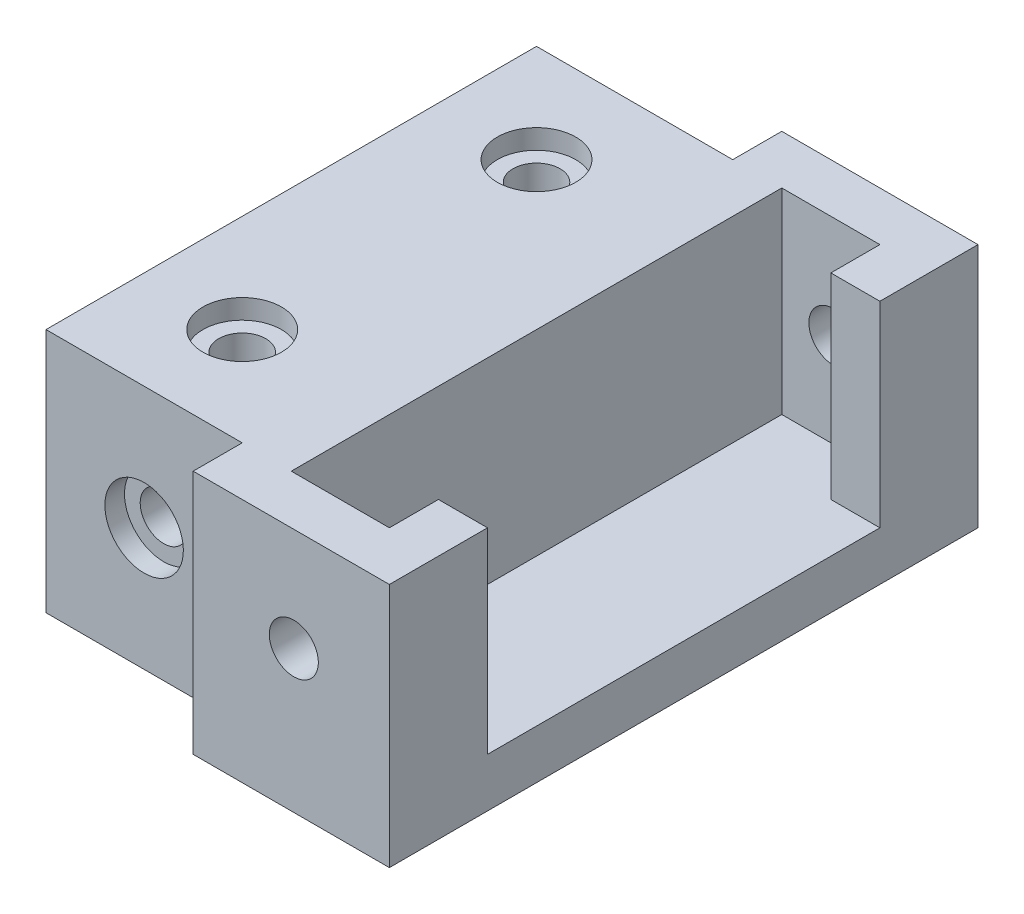
ISO-10303-21;
HEADER;
FILE_DESCRIPTION(('STEP AP214'),'2;1');
FILE_NAME('part.step','',(''),(''),'','','');
FILE_SCHEMA(('AUTOMOTIVE_DESIGN { 1 0 10303 214 1 1 1 1 }'));
ENDSEC;
DATA;
#1=APPLICATION_CONTEXT('core data for automotive mechanical design processes');
#2=APPLICATION_PROTOCOL_DEFINITION('international standard','automotive_design',2000,#1);
#3=PRODUCT_CONTEXT('',#1,'mechanical');
#4=PRODUCT('Part','Part','',(#3));
#5=PRODUCT_RELATED_PRODUCT_CATEGORY('part','',(#4));
#6=PRODUCT_DEFINITION_FORMATION('','',#4);
#7=PRODUCT_DEFINITION_CONTEXT('part definition',#1,'design');
#8=PRODUCT_DEFINITION('design','',#6,#7);
#9=PRODUCT_DEFINITION_SHAPE('','',#8);
#10=(LENGTH_UNIT() NAMED_UNIT(*) SI_UNIT(.MILLI.,.METRE.));
#11=(NAMED_UNIT(*) PLANE_ANGLE_UNIT() SI_UNIT($,.RADIAN.));
#12=(NAMED_UNIT(*) SI_UNIT($,.STERADIAN.) SOLID_ANGLE_UNIT());
#13=UNCERTAINTY_MEASURE_WITH_UNIT(LENGTH_MEASURE(1.E-05),#10,'distance_accuracy_value','');
#14=(GEOMETRIC_REPRESENTATION_CONTEXT(3) GLOBAL_UNCERTAINTY_ASSIGNED_CONTEXT((#13)) GLOBAL_UNIT_ASSIGNED_CONTEXT((#10,
#11,#12)) REPRESENTATION_CONTEXT('',''));
#15=CARTESIAN_POINT('',(0.,0.,0.));
#16=DIRECTION('',(0.,0.,1.));
#17=DIRECTION('',(1.,0.,0.));
#18=AXIS2_PLACEMENT_3D('',#15,#16,#17);
#19=CARTESIAN_POINT('',(0.,20.,0.));
#20=DIRECTION('',(-1.,0.,0.));
#21=DIRECTION('',(0.,0.,1.));
#22=AXIS2_PLACEMENT_3D('',#19,#20,#21);
#23=PLANE('',#22);
#24=DIRECTION('',(0.,0.,-1.));
#25=VECTOR('',#24,1.);
#26=CARTESIAN_POINT('',(0.,-5.,0.));
#27=LINE('',#26,#25);
#28=CARTESIAN_POINT('',(0.,-5.,-55.));
#29=VERTEX_POINT('',#28);
#30=CARTESIAN_POINT('',(0.,-5.,-60.));
#31=VERTEX_POINT('',#30);
#32=EDGE_CURVE('E224',#29,#31,#27,.T.);
#33=ORIENTED_EDGE('',*,*,#32,.F.);
#34=DIRECTION('',(0.,1.,0.));
#35=VECTOR('',#34,1.);
#36=CARTESIAN_POINT('',(0.,0.,-55.));
#37=LINE('',#36,#35);
#38=CARTESIAN_POINT('',(0.,20.,-55.));
#39=VERTEX_POINT('',#38);
#40=EDGE_CURVE('E68',#29,#39,#37,.T.);
#41=ORIENTED_EDGE('',*,*,#40,.T.);
#42=DIRECTION('',(0.,0.,-1.));
#43=VECTOR('',#42,1.);
#44=CARTESIAN_POINT('',(0.,20.,0.));
#45=LINE('',#44,#43);
#46=CARTESIAN_POINT('',(0.,20.,-60.));
#47=VERTEX_POINT('',#46);
#48=EDGE_CURVE('E246',#39,#47,#45,.T.);
#49=ORIENTED_EDGE('',*,*,#48,.T.);
#50=DIRECTION('',(0.,-1.,0.));
#51=VECTOR('',#50,1.);
#52=CARTESIAN_POINT('',(0.,20.,-60.));
#53=LINE('',#52,#51);
#54=EDGE_CURVE('E292',#47,#31,#53,.T.);
#55=ORIENTED_EDGE('',*,*,#54,.T.);
#56=EDGE_LOOP('',(#33,#41,#49,#55));
#57=FACE_BOUND('',#56,.T.);
#58=ADVANCED_FACE('F43',(#57),#23,.T.);
#59=CARTESIAN_POINT('',(0.,-5.,-10.));
#60=VERTEX_POINT('',#59);
#61=CARTESIAN_POINT('',(0.,-5.,-50.));
#62=VERTEX_POINT('',#61);
#63=EDGE_CURVE('E207',#60,#62,#27,.T.);
#64=ORIENTED_EDGE('',*,*,#63,.F.);
#65=DIRECTION('',(0.,1.,0.));
#66=VECTOR('',#65,1.);
#67=CARTESIAN_POINT('',(0.,0.,-10.));
#68=LINE('',#67,#66);
#69=CARTESIAN_POINT('',(0.,15.,-10.));
#70=VERTEX_POINT('',#69);
#71=EDGE_CURVE('E60',#60,#70,#68,.T.);
#72=ORIENTED_EDGE('',*,*,#71,.T.);
#73=DIRECTION('',(0.,0.,1.));
#74=VECTOR('',#73,1.);
#75=CARTESIAN_POINT('',(0.,15.,0.));
#76=LINE('',#75,#74);
#77=CARTESIAN_POINT('',(0.,15.,-50.));
#78=VERTEX_POINT('',#77);
#79=EDGE_CURVE('E345',#78,#70,#76,.T.);
#80=ORIENTED_EDGE('',*,*,#79,.F.);
#81=DIRECTION('',(0.,1.,0.));
#82=VECTOR('',#81,1.);
#83=CARTESIAN_POINT('',(0.,0.,-50.));
#84=LINE('',#83,#82);
#85=EDGE_CURVE('E330',#62,#78,#84,.T.);
#86=ORIENTED_EDGE('',*,*,#85,.F.);
#87=EDGE_LOOP('',(#64,#72,#80,#86));
#88=FACE_BOUND('',#87,.T.);
#89=ADVANCED_FACE('F370',(#88),#23,.T.);
#90=CARTESIAN_POINT('',(5.,20.,0.));
#91=DIRECTION('',(-1.,0.,0.));
#92=DIRECTION('',(0.,0.,1.));
#93=AXIS2_PLACEMENT_3D('',#90,#91,#92);
#94=PLANE('',#93);
#95=DIRECTION('',(0.,0.,-1.));
#96=VECTOR('',#95,1.);
#97=CARTESIAN_POINT('',(5.,0.,0.));
#98=LINE('',#97,#96);
#99=CARTESIAN_POINT('',(5.,0.,-5.));
#100=VERTEX_POINT('',#99);
#101=CARTESIAN_POINT('',(5.,0.,-55.));
#102=VERTEX_POINT('',#101);
#103=EDGE_CURVE('E227',#100,#102,#98,.T.);
#104=ORIENTED_EDGE('',*,*,#103,.T.);
#105=DIRECTION('',(0.,-1.,0.));
#106=VECTOR('',#105,1.);
#107=CARTESIAN_POINT('',(5.,20.,-55.));
#108=LINE('',#107,#106);
#109=CARTESIAN_POINT('',(5.,20.,-55.));
#110=VERTEX_POINT('',#109);
#111=EDGE_CURVE('E11',#110,#102,#108,.T.);
#112=ORIENTED_EDGE('',*,*,#111,.F.);
#113=DIRECTION('',(0.,0.,-1.));
#114=VECTOR('',#113,1.);
#115=CARTESIAN_POINT('',(5.,20.,0.));
#116=LINE('',#115,#114);
#117=CARTESIAN_POINT('',(5.,20.,-5.));
#118=VERTEX_POINT('',#117);
#119=EDGE_CURVE('E229',#118,#110,#116,.T.);
#120=ORIENTED_EDGE('',*,*,#119,.F.);
#121=DIRECTION('',(0.,-1.,0.));
#122=VECTOR('',#121,1.);
#123=CARTESIAN_POINT('',(5.,20.,-5.));
#124=LINE('',#123,#122);
#125=EDGE_CURVE('E262',#118,#100,#124,.T.);
#126=ORIENTED_EDGE('',*,*,#125,.T.);
#127=EDGE_LOOP('',(#104,#112,#120,#126));
#128=FACE_BOUND('',#127,.T.);
#129=ADVANCED_FACE('F45',(#128),#94,.F.);
#130=CARTESIAN_POINT('',(0.,20.,-55.));
#131=DIRECTION('',(0.,0.,-1.));
#132=DIRECTION('',(-1.,0.,0.));
#133=AXIS2_PLACEMENT_3D('',#130,#131,#132);
#134=PLANE('',#133);
#135=CARTESIAN_POINT('',(10.259432597209,9.48113480558206,-55.));
#136=DIRECTION('',(0.,0.,-1.));
#137=DIRECTION('',(-1.,0.,0.));
#138=AXIS2_PLACEMENT_3D('',#135,#136,#137);
#139=CIRCLE('',#138,2.5);
#140=CARTESIAN_POINT('',(7.75943259720897,9.48113480558206,-55.));
#141=VERTEX_POINT('',#140);
#142=EDGE_CURVE('E328',#141,#141,#139,.T.);
#143=ORIENTED_EDGE('',*,*,#142,.T.);
#144=EDGE_LOOP('',(#143));
#145=FACE_BOUND('',#144,.T.);
#146=DIRECTION('',(1.,0.,0.));
#147=VECTOR('',#146,1.);
#148=CARTESIAN_POINT('',(0.,0.,-55.));
#149=LINE('',#148,#147);
#150=CARTESIAN_POINT('',(15.,0.,-55.));
#151=VERTEX_POINT('',#150);
#152=EDGE_CURVE('E265',#102,#151,#149,.T.);
#153=ORIENTED_EDGE('',*,*,#152,.T.);
#154=DIRECTION('',(0.,-1.,0.));
#155=VECTOR('',#154,1.);
#156=CARTESIAN_POINT('',(15.,20.,-55.));
#157=LINE('',#156,#155);
#158=CARTESIAN_POINT('',(15.,20.,-55.));
#159=VERTEX_POINT('',#158);
#160=EDGE_CURVE('E52',#159,#151,#157,.T.);
#161=ORIENTED_EDGE('',*,*,#160,.F.);
#162=DIRECTION('',(1.,0.,0.));
#163=VECTOR('',#162,1.);
#164=CARTESIAN_POINT('',(0.,20.,-55.));
#165=LINE('',#164,#163);
#166=EDGE_CURVE('E232',#110,#159,#165,.T.);
#167=ORIENTED_EDGE('',*,*,#166,.F.);
#168=ORIENTED_EDGE('',*,*,#111,.T.);
#169=EDGE_LOOP('',(#153,#161,#167,#168));
#170=FACE_BOUND('',#169,.T.);
#171=ADVANCED_FACE('F423',(#145,#170),#134,.F.);
#172=CARTESIAN_POINT('',(15.,20.,0.));
#173=DIRECTION('',(-1.,0.,0.));
#174=DIRECTION('',(0.,0.,1.));
#175=AXIS2_PLACEMENT_3D('',#172,#173,#174);
#176=PLANE('',#175);
#177=DIRECTION('',(0.,0.,-1.));
#178=VECTOR('',#177,1.);
#179=CARTESIAN_POINT('',(15.,0.,0.));
#180=LINE('',#179,#178);
#181=CARTESIAN_POINT('',(15.,0.,-50.));
#182=VERTEX_POINT('',#181);
#183=EDGE_CURVE('E268',#182,#151,#180,.T.);
#184=ORIENTED_EDGE('',*,*,#183,.F.);
#185=DIRECTION('',(0.,-1.,0.));
#186=VECTOR('',#185,1.);
#187=CARTESIAN_POINT('',(15.,20.,-50.));
#188=LINE('',#187,#186);
#189=CARTESIAN_POINT('',(15.,20.,-50.));
#190=VERTEX_POINT('',#189);
#191=EDGE_CURVE('E300',#190,#182,#188,.T.);
#192=ORIENTED_EDGE('',*,*,#191,.F.);
#193=DIRECTION('',(0.,0.,-1.));
#194=VECTOR('',#193,1.);
#195=CARTESIAN_POINT('',(15.,20.,0.));
#196=LINE('',#195,#194);
#197=EDGE_CURVE('E235',#190,#159,#196,.T.);
#198=ORIENTED_EDGE('',*,*,#197,.T.);
#199=ORIENTED_EDGE('',*,*,#160,.T.);
#200=EDGE_LOOP('',(#184,#192,#198,#199));
#201=FACE_BOUND('',#200,.T.);
#202=ADVANCED_FACE('F426',(#201),#176,.T.);
#203=CARTESIAN_POINT('',(0.,20.,-50.));
#204=DIRECTION('',(0.,0.,1.));
#205=DIRECTION('',(1.,0.,0.));
#206=AXIS2_PLACEMENT_3D('',#203,#204,#205);
#207=PLANE('',#206);
#208=DIRECTION('',(-1.,0.,0.));
#209=VECTOR('',#208,1.);
#210=CARTESIAN_POINT('',(0.,0.,-50.));
#211=LINE('',#210,#209);
#212=CARTESIAN_POINT('',(20.,0.,-50.));
#213=VERTEX_POINT('',#212);
#214=EDGE_CURVE('E270',#213,#182,#211,.T.);
#215=ORIENTED_EDGE('',*,*,#214,.F.);
#216=DIRECTION('',(0.,-1.,0.));
#217=VECTOR('',#216,1.);
#218=CARTESIAN_POINT('',(20.,20.,-50.));
#219=LINE('',#218,#217);
#220=CARTESIAN_POINT('',(20.,20.,-50.));
#221=VERTEX_POINT('',#220);
#222=EDGE_CURVE('E297',#221,#213,#219,.T.);
#223=ORIENTED_EDGE('',*,*,#222,.F.);
#224=DIRECTION('',(-1.,0.,0.));
#225=VECTOR('',#224,1.);
#226=CARTESIAN_POINT('',(0.,20.,-50.));
#227=LINE('',#226,#225);
#228=EDGE_CURVE('E238',#221,#190,#227,.T.);
#229=ORIENTED_EDGE('',*,*,#228,.T.);
#230=ORIENTED_EDGE('',*,*,#191,.T.);
#231=EDGE_LOOP('',(#215,#223,#229,#230));
#232=FACE_BOUND('',#231,.T.);
#233=ADVANCED_FACE('F429',(#232),#207,.T.);
#234=CARTESIAN_POINT('',(0.,20.,-60.));
#235=DIRECTION('',(0.,0.,-1.));
#236=DIRECTION('',(-1.,0.,0.));
#237=AXIS2_PLACEMENT_3D('',#234,#235,#236);
#238=PLANE('',#237);
#239=CARTESIAN_POINT('',(10.259432597209,9.48113480558206,-60.));
#240=DIRECTION('',(0.,0.,1.));
#241=DIRECTION('',(1.,0.,0.));
#242=AXIS2_PLACEMENT_3D('',#239,#240,#241);
#243=CIRCLE('',#242,2.5);
#244=CARTESIAN_POINT('',(12.759432597209,9.48113480558206,-60.));
#245=VERTEX_POINT('',#244);
#246=EDGE_CURVE('E308',#245,#245,#243,.T.);
#247=ORIENTED_EDGE('',*,*,#246,.T.);
#248=EDGE_LOOP('',(#247));
#249=FACE_BOUND('',#248,.T.);
#250=DIRECTION('',(0.,-1.,0.));
#251=VECTOR('',#250,1.);
#252=CARTESIAN_POINT('',(20.,20.,-60.));
#253=LINE('',#252,#251);
#254=CARTESIAN_POINT('',(20.,20.,-60.));
#255=VERTEX_POINT('',#254);
#256=CARTESIAN_POINT('',(20.,-5.,-60.));
#257=VERTEX_POINT('',#256);
#258=EDGE_CURVE('E295',#255,#257,#253,.T.);
#259=ORIENTED_EDGE('',*,*,#258,.T.);
#260=DIRECTION('',(1.,0.,0.));
#261=VECTOR('',#260,1.);
#262=CARTESIAN_POINT('',(0.,-5.,-60.));
#263=LINE('',#262,#261);
#264=EDGE_CURVE('E221',#31,#257,#263,.T.);
#265=ORIENTED_EDGE('',*,*,#264,.F.);
#266=ORIENTED_EDGE('',*,*,#54,.F.);
#267=DIRECTION('',(1.,0.,0.));
#268=VECTOR('',#267,1.);
#269=CARTESIAN_POINT('',(0.,20.,-60.));
#270=LINE('',#269,#268);
#271=EDGE_CURVE('E243',#47,#255,#270,.T.);
#272=ORIENTED_EDGE('',*,*,#271,.T.);
#273=EDGE_LOOP('',(#259,#265,#266,#272));
#274=FACE_BOUND('',#273,.T.);
#275=ADVANCED_FACE('F389',(#249,#274),#238,.T.);
#276=DIRECTION('',(0.,1.,0.));
#277=VECTOR('',#276,1.);
#278=CARTESIAN_POINT('',(0.,0.,-5.));
#279=LINE('',#278,#277);
#280=CARTESIAN_POINT('',(0.,-5.,-5.));
#281=VERTEX_POINT('',#280);
#282=CARTESIAN_POINT('',(0.,20.,-5.));
#283=VERTEX_POINT('',#282);
#284=EDGE_CURVE('E349',#281,#283,#279,.T.);
#285=ORIENTED_EDGE('',*,*,#284,.F.);
#286=CARTESIAN_POINT('',(0.,-5.,0.));
#287=VERTEX_POINT('',#286);
#288=EDGE_CURVE('E225',#287,#281,#27,.T.);
#289=ORIENTED_EDGE('',*,*,#288,.F.);
#290=DIRECTION('',(0.,-1.,0.));
#291=VECTOR('',#290,1.);
#292=CARTESIAN_POINT('',(0.,20.,0.));
#293=LINE('',#292,#291);
#294=CARTESIAN_POINT('',(0.,20.,0.));
#295=VERTEX_POINT('',#294);
#296=EDGE_CURVE('E290',#295,#287,#293,.T.);
#297=ORIENTED_EDGE('',*,*,#296,.F.);
#298=EDGE_CURVE('E247',#295,#283,#45,.T.);
#299=ORIENTED_EDGE('',*,*,#298,.T.);
#300=EDGE_LOOP('',(#285,#289,#297,#299));
#301=FACE_BOUND('',#300,.T.);
#302=ADVANCED_FACE('F402',(#301),#23,.T.);
#303=CARTESIAN_POINT('',(0.,20.,0.));
#304=DIRECTION('',(0.,0.,-1.));
#305=DIRECTION('',(-1.,0.,0.));
#306=AXIS2_PLACEMENT_3D('',#303,#304,#305);
#307=PLANE('',#306);
#308=CARTESIAN_POINT('',(10.259432597209,9.48113480558206,0.));
#309=DIRECTION('',(0.,0.,-1.));
#310=DIRECTION('',(-1.,0.,0.));
#311=AXIS2_PLACEMENT_3D('',#308,#309,#310);
#312=CIRCLE('',#311,2.5);
#313=CARTESIAN_POINT('',(7.75943259720897,9.48113480558206,0.));
#314=VERTEX_POINT('',#313);
#315=EDGE_CURVE('E307',#314,#314,#312,.T.);
#316=ORIENTED_EDGE('',*,*,#315,.T.);
#317=EDGE_LOOP('',(#316));
#318=FACE_BOUND('',#317,.T.);
#319=ORIENTED_EDGE('',*,*,#296,.T.);
#320=DIRECTION('',(1.,0.,0.));
#321=VECTOR('',#320,1.);
#322=CARTESIAN_POINT('',(0.,-5.,0.));
#323=LINE('',#322,#321);
#324=CARTESIAN_POINT('',(20.,-5.,0.));
#325=VERTEX_POINT('',#324);
#326=EDGE_CURVE('E210',#287,#325,#323,.T.);
#327=ORIENTED_EDGE('',*,*,#326,.T.);
#328=DIRECTION('',(0.,-1.,0.));
#329=VECTOR('',#328,1.);
#330=CARTESIAN_POINT('',(20.,20.,0.));
#331=LINE('',#330,#329);
#332=CARTESIAN_POINT('',(20.,20.,0.));
#333=VERTEX_POINT('',#332);
#334=EDGE_CURVE('E288',#333,#325,#331,.T.);
#335=ORIENTED_EDGE('',*,*,#334,.F.);
#336=DIRECTION('',(1.,0.,0.));
#337=VECTOR('',#336,1.);
#338=CARTESIAN_POINT('',(0.,20.,0.));
#339=LINE('',#338,#337);
#340=EDGE_CURVE('E249',#295,#333,#339,.T.);
#341=ORIENTED_EDGE('',*,*,#340,.F.);
#342=EDGE_LOOP('',(#319,#327,#335,#341));
#343=FACE_BOUND('',#342,.T.);
#344=ADVANCED_FACE('F398',(#318,#343),#307,.F.);
#345=CARTESIAN_POINT('',(20.,20.,0.));
#346=DIRECTION('',(-1.,0.,0.));
#347=DIRECTION('',(0.,0.,1.));
#348=AXIS2_PLACEMENT_3D('',#345,#346,#347);
#349=PLANE('',#348);
#350=ORIENTED_EDGE('',*,*,#334,.T.);
#351=DIRECTION('',(0.,0.,-1.));
#352=VECTOR('',#351,1.);
#353=CARTESIAN_POINT('',(20.,-5.,0.));
#354=LINE('',#353,#352);
#355=EDGE_CURVE('E218',#325,#257,#354,.T.);
#356=ORIENTED_EDGE('',*,*,#355,.T.);
#357=ORIENTED_EDGE('',*,*,#258,.F.);
#358=DIRECTION('',(0.,0.,-1.));
#359=VECTOR('',#358,1.);
#360=CARTESIAN_POINT('',(20.,20.,0.));
#361=LINE('',#360,#359);
#362=EDGE_CURVE('E241',#221,#255,#361,.T.);
#363=ORIENTED_EDGE('',*,*,#362,.F.);
#364=ORIENTED_EDGE('',*,*,#222,.T.);
#365=DIRECTION('',(0.,0.,-1.));
#366=VECTOR('',#365,1.);
#367=CARTESIAN_POINT('',(20.,0.,0.));
#368=LINE('',#367,#366);
#369=CARTESIAN_POINT('',(20.,0.,-10.));
#370=VERTEX_POINT('',#369);
#371=EDGE_CURVE('E208',#370,#213,#368,.T.);
#372=ORIENTED_EDGE('',*,*,#371,.F.);
#373=DIRECTION('',(0.,-1.,0.));
#374=VECTOR('',#373,1.);
#375=CARTESIAN_POINT('',(20.,20.,-10.));
#376=LINE('',#375,#374);
#377=CARTESIAN_POINT('',(20.,20.,-10.));
#378=VERTEX_POINT('',#377);
#379=EDGE_CURVE('E285',#378,#370,#376,.T.);
#380=ORIENTED_EDGE('',*,*,#379,.F.);
#381=DIRECTION('',(0.,0.,-1.));
#382=VECTOR('',#381,1.);
#383=CARTESIAN_POINT('',(20.,20.,0.));
#384=LINE('',#383,#382);
#385=EDGE_CURVE('E251',#333,#378,#384,.T.);
#386=ORIENTED_EDGE('',*,*,#385,.F.);
#387=EDGE_LOOP('',(#350,#356,#357,#363,#364,#372,#380,#386));
#388=FACE_BOUND('',#387,.T.);
#389=ADVANCED_FACE('F393',(#388),#349,.F.);
#390=CARTESIAN_POINT('',(0.,20.,-10.));
#391=DIRECTION('',(0.,0.,-1.));
#392=DIRECTION('',(-1.,0.,0.));
#393=AXIS2_PLACEMENT_3D('',#390,#391,#392);
#394=PLANE('',#393);
#395=DIRECTION('',(1.,0.,0.));
#396=VECTOR('',#395,1.);
#397=CARTESIAN_POINT('',(0.,0.,-10.));
#398=LINE('',#397,#396);
#399=CARTESIAN_POINT('',(15.,0.,-10.));
#400=VERTEX_POINT('',#399);
#401=EDGE_CURVE('E272',#400,#370,#398,.T.);
#402=ORIENTED_EDGE('',*,*,#401,.F.);
#403=DIRECTION('',(0.,-1.,0.));
#404=VECTOR('',#403,1.);
#405=CARTESIAN_POINT('',(15.,20.,-10.));
#406=LINE('',#405,#404);
#407=CARTESIAN_POINT('',(15.,20.,-10.));
#408=VERTEX_POINT('',#407);
#409=EDGE_CURVE('E282',#408,#400,#406,.T.);
#410=ORIENTED_EDGE('',*,*,#409,.F.);
#411=DIRECTION('',(1.,0.,0.));
#412=VECTOR('',#411,1.);
#413=CARTESIAN_POINT('',(0.,20.,-10.));
#414=LINE('',#413,#412);
#415=EDGE_CURVE('E253',#408,#378,#414,.T.);
#416=ORIENTED_EDGE('',*,*,#415,.T.);
#417=ORIENTED_EDGE('',*,*,#379,.T.);
#418=EDGE_LOOP('',(#402,#410,#416,#417));
#419=FACE_BOUND('',#418,.T.);
#420=ADVANCED_FACE('F409',(#419),#394,.T.);
#421=CARTESIAN_POINT('',(15.,20.,0.));
#422=DIRECTION('',(-1.,0.,0.));
#423=DIRECTION('',(0.,0.,1.));
#424=AXIS2_PLACEMENT_3D('',#421,#422,#423);
#425=PLANE('',#424);
#426=DIRECTION('',(0.,0.,-1.));
#427=VECTOR('',#426,1.);
#428=CARTESIAN_POINT('',(15.,0.,0.));
#429=LINE('',#428,#427);
#430=CARTESIAN_POINT('',(15.,0.,-5.));
#431=VERTEX_POINT('',#430);
#432=EDGE_CURVE('E274',#431,#400,#429,.T.);
#433=ORIENTED_EDGE('',*,*,#432,.F.);
#434=DIRECTION('',(0.,-1.,0.));
#435=VECTOR('',#434,1.);
#436=CARTESIAN_POINT('',(15.,20.,-5.));
#437=LINE('',#436,#435);
#438=CARTESIAN_POINT('',(15.,20.,-5.));
#439=VERTEX_POINT('',#438);
#440=EDGE_CURVE('E279',#439,#431,#437,.T.);
#441=ORIENTED_EDGE('',*,*,#440,.F.);
#442=DIRECTION('',(0.,0.,-1.));
#443=VECTOR('',#442,1.);
#444=CARTESIAN_POINT('',(15.,20.,0.));
#445=LINE('',#444,#443);
#446=EDGE_CURVE('E256',#439,#408,#445,.T.);
#447=ORIENTED_EDGE('',*,*,#446,.T.);
#448=ORIENTED_EDGE('',*,*,#409,.T.);
#449=EDGE_LOOP('',(#433,#441,#447,#448));
#450=FACE_BOUND('',#449,.T.);
#451=ADVANCED_FACE('F412',(#450),#425,.T.);
#452=CARTESIAN_POINT('',(0.,20.,-5.));
#453=DIRECTION('',(0.,0.,-1.));
#454=DIRECTION('',(-1.,0.,0.));
#455=AXIS2_PLACEMENT_3D('',#452,#453,#454);
#456=PLANE('',#455);
#457=CARTESIAN_POINT('',(10.259432597209,9.48113480558206,-5.));
#458=DIRECTION('',(0.,0.,-1.));
#459=DIRECTION('',(-1.,0.,0.));
#460=AXIS2_PLACEMENT_3D('',#457,#458,#459);
#461=CIRCLE('',#460,2.5);
#462=CARTESIAN_POINT('',(7.75943259720897,9.48113480558206,-5.));
#463=VERTEX_POINT('',#462);
#464=EDGE_CURVE('E305',#463,#463,#461,.T.);
#465=ORIENTED_EDGE('',*,*,#464,.F.);
#466=EDGE_LOOP('',(#465));
#467=FACE_BOUND('',#466,.T.);
#468=DIRECTION('',(1.,0.,0.));
#469=VECTOR('',#468,1.);
#470=CARTESIAN_POINT('',(0.,0.,-5.));
#471=LINE('',#470,#469);
#472=EDGE_CURVE('E233',#100,#431,#471,.T.);
#473=ORIENTED_EDGE('',*,*,#472,.F.);
#474=ORIENTED_EDGE('',*,*,#125,.F.);
#475=DIRECTION('',(1.,0.,0.));
#476=VECTOR('',#475,1.);
#477=CARTESIAN_POINT('',(0.,20.,-5.));
#478=LINE('',#477,#476);
#479=EDGE_CURVE('E259',#118,#439,#478,.T.);
#480=ORIENTED_EDGE('',*,*,#479,.T.);
#481=ORIENTED_EDGE('',*,*,#440,.T.);
#482=EDGE_LOOP('',(#473,#474,#480,#481));
#483=FACE_BOUND('',#482,.T.);
#484=ADVANCED_FACE('F416',(#467,#483),#456,.T.);
#485=CARTESIAN_POINT('',(0.,20.,0.));
#486=DIRECTION('',(0.,1.,0.));
#487=DIRECTION('',(0.,0.,1.));
#488=AXIS2_PLACEMENT_3D('',#485,#486,#487);
#489=PLANE('',#488);
#490=CARTESIAN_POINT('',(-10.,20.,-45.));
#491=DIRECTION('',(0.,1.,0.));
#492=DIRECTION('',(0.,0.,1.));
#493=AXIS2_PLACEMENT_3D('',#490,#491,#492);
#494=CIRCLE('',#493,3.99999999999999);
#495=CARTESIAN_POINT('',(-10.,20.,-41.));
#496=VERTEX_POINT('',#495);
#497=EDGE_CURVE('E516',#496,#496,#494,.T.);
#498=ORIENTED_EDGE('',*,*,#497,.F.);
#499=EDGE_LOOP('',(#498));
#500=FACE_BOUND('',#499,.T.);
#501=CARTESIAN_POINT('',(-9.99999999999999,20.,-15.));
#502=DIRECTION('',(0.,1.,0.));
#503=DIRECTION('',(0.,0.,1.));
#504=AXIS2_PLACEMENT_3D('',#501,#502,#503);
#505=CIRCLE('',#504,3.99999999999999);
#506=CARTESIAN_POINT('',(-9.99999999999999,20.,-11.));
#507=VERTEX_POINT('',#506);
#508=EDGE_CURVE('E322',#507,#507,#505,.T.);
#509=ORIENTED_EDGE('',*,*,#508,.F.);
#510=EDGE_LOOP('',(#509));
#511=FACE_BOUND('',#510,.T.);
#512=ORIENTED_EDGE('',*,*,#119,.T.);
#513=ORIENTED_EDGE('',*,*,#166,.T.);
#514=ORIENTED_EDGE('',*,*,#197,.F.);
#515=ORIENTED_EDGE('',*,*,#228,.F.);
#516=ORIENTED_EDGE('',*,*,#362,.T.);
#517=ORIENTED_EDGE('',*,*,#271,.F.);
#518=ORIENTED_EDGE('',*,*,#48,.F.);
#519=DIRECTION('',(1.,0.,0.));
#520=VECTOR('',#519,1.);
#521=CARTESIAN_POINT('',(-20.,20.,-55.));
#522=LINE('',#521,#520);
#523=CARTESIAN_POINT('',(-20.,20.,-55.));
#524=VERTEX_POINT('',#523);
#525=EDGE_CURVE('E354',#524,#39,#522,.T.);
#526=ORIENTED_EDGE('',*,*,#525,.F.);
#527=DIRECTION('',(0.,0.,-1.));
#528=VECTOR('',#527,1.);
#529=CARTESIAN_POINT('',(-20.,20.,0.));
#530=LINE('',#529,#528);
#531=CARTESIAN_POINT('',(-20.,20.,-5.));
#532=VERTEX_POINT('',#531);
#533=EDGE_CURVE('E340',#532,#524,#530,.T.);
#534=ORIENTED_EDGE('',*,*,#533,.F.);
#535=DIRECTION('',(1.,0.,0.));
#536=VECTOR('',#535,1.);
#537=CARTESIAN_POINT('',(-20.,20.,-5.));
#538=LINE('',#537,#536);
#539=EDGE_CURVE('E357',#532,#283,#538,.T.);
#540=ORIENTED_EDGE('',*,*,#539,.T.);
#541=ORIENTED_EDGE('',*,*,#298,.F.);
#542=ORIENTED_EDGE('',*,*,#340,.T.);
#543=ORIENTED_EDGE('',*,*,#385,.T.);
#544=ORIENTED_EDGE('',*,*,#415,.F.);
#545=ORIENTED_EDGE('',*,*,#446,.F.);
#546=ORIENTED_EDGE('',*,*,#479,.F.);
#547=EDGE_LOOP('',(#512,#513,#514,#515,#516,#517,#518,#526,#534,#540,#541,#542,#543,#544,#545,#546));
#548=FACE_BOUND('',#547,.T.);
#549=ADVANCED_FACE('F381',(#500,#511,#548),#489,.T.);
#550=CARTESIAN_POINT('',(0.,-5.,0.));
#551=DIRECTION('',(0.,1.,0.));
#552=DIRECTION('',(0.,0.,1.));
#553=AXIS2_PLACEMENT_3D('',#550,#551,#552);
#554=PLANE('',#553);
#555=ORIENTED_EDGE('',*,*,#326,.F.);
#556=ORIENTED_EDGE('',*,*,#288,.T.);
#557=DIRECTION('',(1.,0.,0.));
#558=VECTOR('',#557,1.);
#559=CARTESIAN_POINT('',(-20.,-5.,-5.));
#560=LINE('',#559,#558);
#561=CARTESIAN_POINT('',(-20.,-5.,-5.));
#562=VERTEX_POINT('',#561);
#563=EDGE_CURVE('E360',#562,#281,#560,.T.);
#564=ORIENTED_EDGE('',*,*,#563,.F.);
#565=DIRECTION('',(0.,0.,1.));
#566=VECTOR('',#565,1.);
#567=CARTESIAN_POINT('',(-20.,-5.,0.));
#568=LINE('',#567,#566);
#569=CARTESIAN_POINT('',(-20.,-5.,-10.));
#570=VERTEX_POINT('',#569);
#571=EDGE_CURVE('E336',#570,#562,#568,.T.);
#572=ORIENTED_EDGE('',*,*,#571,.F.);
#573=DIRECTION('',(1.,0.,0.));
#574=VECTOR('',#573,1.);
#575=CARTESIAN_POINT('',(-20.,-5.,-10.));
#576=LINE('',#575,#574);
#577=EDGE_CURVE('E363',#570,#60,#576,.T.);
#578=ORIENTED_EDGE('',*,*,#577,.T.);
#579=ORIENTED_EDGE('',*,*,#63,.T.);
#580=DIRECTION('',(1.,0.,0.));
#581=VECTOR('',#580,1.);
#582=CARTESIAN_POINT('',(-20.,-5.,-50.));
#583=LINE('',#582,#581);
#584=CARTESIAN_POINT('',(-20.,-5.,-50.));
#585=VERTEX_POINT('',#584);
#586=EDGE_CURVE('E187',#585,#62,#583,.T.);
#587=ORIENTED_EDGE('',*,*,#586,.F.);
#588=DIRECTION('',(0.,0.,1.));
#589=VECTOR('',#588,1.);
#590=CARTESIAN_POINT('',(-20.,-5.,0.));
#591=LINE('',#590,#589);
#592=CARTESIAN_POINT('',(-20.,-5.,-55.));
#593=VERTEX_POINT('',#592);
#594=EDGE_CURVE('E193',#593,#585,#591,.T.);
#595=ORIENTED_EDGE('',*,*,#594,.F.);
#596=DIRECTION('',(1.,0.,0.));
#597=VECTOR('',#596,1.);
#598=CARTESIAN_POINT('',(-20.,-5.,-55.));
#599=LINE('',#598,#597);
#600=EDGE_CURVE('E343',#593,#29,#599,.T.);
#601=ORIENTED_EDGE('',*,*,#600,.T.);
#602=ORIENTED_EDGE('',*,*,#32,.T.);
#603=ORIENTED_EDGE('',*,*,#264,.T.);
#604=ORIENTED_EDGE('',*,*,#355,.F.);
#605=EDGE_LOOP('',(#555,#556,#564,#572,#578,#579,#587,#595,#601,#602,#603,#604));
#606=FACE_BOUND('',#605,.T.);
#607=ADVANCED_FACE('F205',(#606),#554,.F.);
#608=CARTESIAN_POINT('',(0.,0.,0.));
#609=DIRECTION('',(0.,1.,0.));
#610=DIRECTION('',(0.,0.,1.));
#611=AXIS2_PLACEMENT_3D('',#608,#609,#610);
#612=PLANE('',#611);
#613=ORIENTED_EDGE('',*,*,#432,.T.);
#614=ORIENTED_EDGE('',*,*,#401,.T.);
#615=ORIENTED_EDGE('',*,*,#371,.T.);
#616=ORIENTED_EDGE('',*,*,#214,.T.);
#617=ORIENTED_EDGE('',*,*,#183,.T.);
#618=ORIENTED_EDGE('',*,*,#152,.F.);
#619=ORIENTED_EDGE('',*,*,#103,.F.);
#620=ORIENTED_EDGE('',*,*,#472,.T.);
#621=EDGE_LOOP('',(#613,#614,#615,#616,#617,#618,#619,#620));
#622=FACE_BOUND('',#621,.T.);
#623=ADVANCED_FACE('F431',(#622),#612,.T.);
#624=CARTESIAN_POINT('',(-20.,0.,-50.));
#625=DIRECTION('',(0.,0.,-1.));
#626=DIRECTION('',(-1.,0.,0.));
#627=AXIS2_PLACEMENT_3D('',#624,#625,#626);
#628=PLANE('',#627);
#629=CARTESIAN_POINT('',(-10.,7.5,-50.));
#630=DIRECTION('',(0.,0.,-1.));
#631=DIRECTION('',(-1.,0.,0.));
#632=AXIS2_PLACEMENT_3D('',#629,#630,#631);
#633=CIRCLE('',#632,2.39999999999999);
#634=CARTESIAN_POINT('',(-12.4,7.5,-50.));
#635=VERTEX_POINT('',#634);
#636=EDGE_CURVE('E528',#635,#635,#633,.T.);
#637=ORIENTED_EDGE('',*,*,#636,.T.);
#638=EDGE_LOOP('',(#637));
#639=FACE_BOUND('',#638,.T.);
#640=ORIENTED_EDGE('',*,*,#85,.T.);
#641=DIRECTION('',(1.,0.,0.));
#642=VECTOR('',#641,1.);
#643=CARTESIAN_POINT('',(-20.,15.,-50.));
#644=LINE('',#643,#642);
#645=CARTESIAN_POINT('',(-20.,15.,-50.));
#646=VERTEX_POINT('',#645);
#647=EDGE_CURVE('E189',#646,#78,#644,.T.);
#648=ORIENTED_EDGE('',*,*,#647,.F.);
#649=DIRECTION('',(0.,1.,0.));
#650=VECTOR('',#649,1.);
#651=CARTESIAN_POINT('',(-20.,0.,-50.));
#652=LINE('',#651,#650);
#653=EDGE_CURVE('E182',#585,#646,#652,.T.);
#654=ORIENTED_EDGE('',*,*,#653,.F.);
#655=ORIENTED_EDGE('',*,*,#586,.T.);
#656=EDGE_LOOP('',(#640,#648,#654,#655));
#657=FACE_BOUND('',#656,.T.);
#658=ADVANCED_FACE('F185',(#639,#657),#628,.F.);
#659=CARTESIAN_POINT('',(-20.,15.,0.));
#660=DIRECTION('',(0.,1.,0.));
#661=DIRECTION('',(0.,0.,1.));
#662=AXIS2_PLACEMENT_3D('',#659,#660,#661);
#663=PLANE('',#662);
#664=CARTESIAN_POINT('',(-10.,15.,-45.));
#665=DIRECTION('',(0.,1.,0.));
#666=DIRECTION('',(0.,0.,1.));
#667=AXIS2_PLACEMENT_3D('',#664,#665,#666);
#668=CIRCLE('',#667,2.4);
#669=CARTESIAN_POINT('',(-10.,15.,-42.6));
#670=VERTEX_POINT('',#669);
#671=EDGE_CURVE('E47',#670,#670,#668,.T.);
#672=ORIENTED_EDGE('',*,*,#671,.T.);
#673=EDGE_LOOP('',(#672));
#674=FACE_BOUND('',#673,.T.);
#675=CARTESIAN_POINT('',(-9.99999999999999,15.,-15.));
#676=DIRECTION('',(0.,1.,0.));
#677=DIRECTION('',(0.,0.,1.));
#678=AXIS2_PLACEMENT_3D('',#675,#676,#677);
#679=CIRCLE('',#678,2.4);
#680=CARTESIAN_POINT('',(-9.99999999999999,15.,-12.6));
#681=VERTEX_POINT('',#680);
#682=EDGE_CURVE('E309',#681,#681,#679,.T.);
#683=ORIENTED_EDGE('',*,*,#682,.T.);
#684=EDGE_LOOP('',(#683));
#685=FACE_BOUND('',#684,.T.);
#686=ORIENTED_EDGE('',*,*,#79,.T.);
#687=DIRECTION('',(1.,0.,0.));
#688=VECTOR('',#687,1.);
#689=CARTESIAN_POINT('',(-20.,15.,-10.));
#690=LINE('',#689,#688);
#691=CARTESIAN_POINT('',(-20.,15.,-10.));
#692=VERTEX_POINT('',#691);
#693=EDGE_CURVE('E212',#692,#70,#690,.T.);
#694=ORIENTED_EDGE('',*,*,#693,.F.);
#695=DIRECTION('',(0.,0.,1.));
#696=VECTOR('',#695,1.);
#697=CARTESIAN_POINT('',(-20.,15.,0.));
#698=LINE('',#697,#696);
#699=EDGE_CURVE('E192',#646,#692,#698,.T.);
#700=ORIENTED_EDGE('',*,*,#699,.F.);
#701=ORIENTED_EDGE('',*,*,#647,.T.);
#702=EDGE_LOOP('',(#686,#694,#700,#701));
#703=FACE_BOUND('',#702,.T.);
#704=ADVANCED_FACE('F369',(#674,#685,#703),#663,.F.);
#705=CARTESIAN_POINT('',(-20.,0.,-10.));
#706=DIRECTION('',(0.,0.,-1.));
#707=DIRECTION('',(-1.,0.,0.));
#708=AXIS2_PLACEMENT_3D('',#705,#706,#707);
#709=PLANE('',#708);
#710=CARTESIAN_POINT('',(-10.,7.5,-10.));
#711=DIRECTION('',(0.,0.,-1.));
#712=DIRECTION('',(-1.,0.,0.));
#713=AXIS2_PLACEMENT_3D('',#710,#711,#712);
#714=CIRCLE('',#713,2.39999999999999);
#715=CARTESIAN_POINT('',(-12.4,7.5,-10.));
#716=VERTEX_POINT('',#715);
#717=EDGE_CURVE('E525',#716,#716,#714,.T.);
#718=ORIENTED_EDGE('',*,*,#717,.F.);
#719=EDGE_LOOP('',(#718));
#720=FACE_BOUND('',#719,.T.);
#721=ORIENTED_EDGE('',*,*,#71,.F.);
#722=ORIENTED_EDGE('',*,*,#577,.F.);
#723=DIRECTION('',(0.,1.,0.));
#724=VECTOR('',#723,1.);
#725=CARTESIAN_POINT('',(-20.,0.,-10.));
#726=LINE('',#725,#724);
#727=EDGE_CURVE('E333',#570,#692,#726,.T.);
#728=ORIENTED_EDGE('',*,*,#727,.T.);
#729=ORIENTED_EDGE('',*,*,#693,.T.);
#730=EDGE_LOOP('',(#721,#722,#728,#729));
#731=FACE_BOUND('',#730,.T.);
#732=ADVANCED_FACE('F366',(#720,#731),#709,.T.);
#733=CARTESIAN_POINT('',(-20.,0.,-5.));
#734=DIRECTION('',(0.,0.,-1.));
#735=DIRECTION('',(0.,1.,0.));
#736=AXIS2_PLACEMENT_3D('',#733,#734,#735);
#737=PLANE('',#736);
#738=CARTESIAN_POINT('',(-10.,7.5,-5.));
#739=DIRECTION('',(0.,0.,1.));
#740=DIRECTION('',(0.,-1.,0.));
#741=AXIS2_PLACEMENT_3D('',#738,#739,#740);
#742=CIRCLE('',#741,3.99999999999999);
#743=CARTESIAN_POINT('',(-10.,3.50000000000001,-5.));
#744=VERTEX_POINT('',#743);
#745=EDGE_CURVE('E924',#744,#744,#742,.T.);
#746=ORIENTED_EDGE('',*,*,#745,.F.);
#747=EDGE_LOOP('',(#746));
#748=FACE_BOUND('',#747,.T.);
#749=ORIENTED_EDGE('',*,*,#284,.T.);
#750=ORIENTED_EDGE('',*,*,#539,.F.);
#751=DIRECTION('',(0.,1.,0.));
#752=VECTOR('',#751,1.);
#753=CARTESIAN_POINT('',(-20.,0.,-5.));
#754=LINE('',#753,#752);
#755=EDGE_CURVE('E338',#562,#532,#754,.T.);
#756=ORIENTED_EDGE('',*,*,#755,.F.);
#757=ORIENTED_EDGE('',*,*,#563,.T.);
#758=EDGE_LOOP('',(#749,#750,#756,#757));
#759=FACE_BOUND('',#758,.T.);
#760=ADVANCED_FACE('F378',(#748,#759),#737,.F.);
#761=CARTESIAN_POINT('',(-20.,0.,-55.));
#762=DIRECTION('',(0.,0.,-1.));
#763=DIRECTION('',(-1.,0.,0.));
#764=AXIS2_PLACEMENT_3D('',#761,#762,#763);
#765=PLANE('',#764);
#766=CARTESIAN_POINT('',(-10.,7.5,-55.));
#767=DIRECTION('',(0.,0.,-1.));
#768=DIRECTION('',(-1.,0.,0.));
#769=AXIS2_PLACEMENT_3D('',#766,#767,#768);
#770=CIRCLE('',#769,3.99999999999999);
#771=CARTESIAN_POINT('',(-14.,7.5,-55.));
#772=VERTEX_POINT('',#771);
#773=EDGE_CURVE('E505',#772,#772,#770,.T.);
#774=ORIENTED_EDGE('',*,*,#773,.F.);
#775=EDGE_LOOP('',(#774));
#776=FACE_BOUND('',#775,.T.);
#777=ORIENTED_EDGE('',*,*,#40,.F.);
#778=ORIENTED_EDGE('',*,*,#600,.F.);
#779=DIRECTION('',(0.,1.,0.));
#780=VECTOR('',#779,1.);
#781=CARTESIAN_POINT('',(-20.,0.,-55.));
#782=LINE('',#781,#780);
#783=EDGE_CURVE('E199',#593,#524,#782,.T.);
#784=ORIENTED_EDGE('',*,*,#783,.T.);
#785=ORIENTED_EDGE('',*,*,#525,.T.);
#786=EDGE_LOOP('',(#777,#778,#784,#785));
#787=FACE_BOUND('',#786,.T.);
#788=ADVANCED_FACE('F384',(#776,#787),#765,.T.);
#789=CARTESIAN_POINT('',(-20.,0.,0.));
#790=DIRECTION('',(-1.,0.,0.));
#791=DIRECTION('',(0.,0.,1.));
#792=AXIS2_PLACEMENT_3D('',#789,#790,#791);
#793=PLANE('',#792);
#794=ORIENTED_EDGE('',*,*,#594,.T.);
#795=ORIENTED_EDGE('',*,*,#653,.T.);
#796=ORIENTED_EDGE('',*,*,#699,.T.);
#797=ORIENTED_EDGE('',*,*,#727,.F.);
#798=ORIENTED_EDGE('',*,*,#571,.T.);
#799=ORIENTED_EDGE('',*,*,#755,.T.);
#800=ORIENTED_EDGE('',*,*,#533,.T.);
#801=ORIENTED_EDGE('',*,*,#783,.F.);
#802=EDGE_LOOP('',(#794,#795,#796,#797,#798,#799,#800,#801));
#803=FACE_BOUND('',#802,.T.);
#804=ADVANCED_FACE('F197',(#803),#793,.T.);
#805=CARTESIAN_POINT('',(10.259432597209,9.48113480558206,-60.));
#806=DIRECTION('',(0.,0.,1.));
#807=DIRECTION('',(1.,0.,0.));
#808=AXIS2_PLACEMENT_3D('',#805,#806,#807);
#809=CYLINDRICAL_SURFACE('',#808,2.5);
#810=ORIENTED_EDGE('',*,*,#464,.T.);
#811=EDGE_LOOP('',(#810));
#812=FACE_BOUND('',#811,.T.);
#813=ORIENTED_EDGE('',*,*,#315,.F.);
#814=EDGE_LOOP('',(#813));
#815=FACE_BOUND('',#814,.T.);
#816=ADVANCED_FACE('F474',(#812,#815),#809,.F.);
#817=ORIENTED_EDGE('',*,*,#246,.F.);
#818=EDGE_LOOP('',(#817));
#819=FACE_BOUND('',#818,.T.);
#820=ORIENTED_EDGE('',*,*,#142,.F.);
#821=EDGE_LOOP('',(#820));
#822=FACE_BOUND('',#821,.T.);
#823=ADVANCED_FACE('F471',(#819,#822),#809,.F.);
#824=CARTESIAN_POINT('',(-9.99999999999999,20.,-15.));
#825=DIRECTION('',(0.,1.,0.));
#826=DIRECTION('',(0.,0.,1.));
#827=AXIS2_PLACEMENT_3D('',#824,#825,#826);
#828=CYLINDRICAL_SURFACE('',#827,2.4);
#829=CARTESIAN_POINT('',(-9.99999999999999,18.,-15.));
#830=DIRECTION('',(0.,1.,0.));
#831=DIRECTION('',(0.,0.,1.));
#832=AXIS2_PLACEMENT_3D('',#829,#830,#831);
#833=CIRCLE('',#832,2.4);
#834=CARTESIAN_POINT('',(-9.99999999999999,18.,-12.6));
#835=VERTEX_POINT('',#834);
#836=EDGE_CURVE('E311',#835,#835,#833,.T.);
#837=ORIENTED_EDGE('',*,*,#836,.T.);
#838=EDGE_LOOP('',(#837));
#839=FACE_BOUND('',#838,.T.);
#840=ORIENTED_EDGE('',*,*,#682,.F.);
#841=EDGE_LOOP('',(#840));
#842=FACE_BOUND('',#841,.T.);
#843=ADVANCED_FACE('F473',(#839,#842),#828,.F.);
#844=CARTESIAN_POINT('',(-7.59999999999999,18.,-15.));
#845=DIRECTION('',(0.,-1.,0.));
#846=DIRECTION('',(0.,0.,-1.));
#847=AXIS2_PLACEMENT_3D('',#844,#845,#846);
#848=PLANE('',#847);
#849=ORIENTED_EDGE('',*,*,#836,.F.);
#850=EDGE_LOOP('',(#849));
#851=FACE_BOUND('',#850,.T.);
#852=CARTESIAN_POINT('',(-9.99999999999999,18.,-15.));
#853=DIRECTION('',(0.,1.,0.));
#854=DIRECTION('',(0.,0.,1.));
#855=AXIS2_PLACEMENT_3D('',#852,#853,#854);
#856=CIRCLE('',#855,4.);
#857=CARTESIAN_POINT('',(-9.99999999999999,18.,-11.));
#858=VERTEX_POINT('',#857);
#859=EDGE_CURVE('E317',#858,#858,#856,.T.);
#860=ORIENTED_EDGE('',*,*,#859,.T.);
#861=EDGE_LOOP('',(#860));
#862=FACE_BOUND('',#861,.T.);
#863=ADVANCED_FACE('F482',(#851,#862),#848,.F.);
#864=CARTESIAN_POINT('',(-9.99999999999999,20.,-15.));
#865=DIRECTION('',(0.,1.,0.));
#866=DIRECTION('',(0.,0.,1.));
#867=AXIS2_PLACEMENT_3D('',#864,#865,#866);
#868=CYLINDRICAL_SURFACE('',#867,4.);
#869=ORIENTED_EDGE('',*,*,#859,.F.);
#870=EDGE_LOOP('',(#869));
#871=FACE_BOUND('',#870,.T.);
#872=ORIENTED_EDGE('',*,*,#508,.T.);
#873=EDGE_LOOP('',(#872));
#874=FACE_BOUND('',#873,.T.);
#875=ADVANCED_FACE('F533',(#871,#874),#868,.F.);
#876=CARTESIAN_POINT('',(-10.,7.5,-55.));
#877=DIRECTION('',(0.,0.,-1.));
#878=DIRECTION('',(-1.,0.,0.));
#879=AXIS2_PLACEMENT_3D('',#876,#877,#878);
#880=CYLINDRICAL_SURFACE('',#879,2.39999999999999);
#881=CARTESIAN_POINT('',(-10.,7.5,-53.));
#882=DIRECTION('',(0.,0.,-1.));
#883=DIRECTION('',(-1.,0.,0.));
#884=AXIS2_PLACEMENT_3D('',#881,#882,#883);
#885=CIRCLE('',#884,2.4);
#886=CARTESIAN_POINT('',(-12.4,7.5,-53.));
#887=VERTEX_POINT('',#886);
#888=EDGE_CURVE('E522',#887,#887,#885,.T.);
#889=ORIENTED_EDGE('',*,*,#888,.T.);
#890=EDGE_LOOP('',(#889));
#891=FACE_BOUND('',#890,.T.);
#892=ORIENTED_EDGE('',*,*,#636,.F.);
#893=EDGE_LOOP('',(#892));
#894=FACE_BOUND('',#893,.T.);
#895=ADVANCED_FACE('F827',(#891,#894),#880,.F.);
#896=CARTESIAN_POINT('',(-7.6,7.5,-53.));
#897=DIRECTION('',(0.,0.,1.));
#898=DIRECTION('',(1.,0.,0.));
#899=AXIS2_PLACEMENT_3D('',#896,#897,#898);
#900=PLANE('',#899);
#901=ORIENTED_EDGE('',*,*,#888,.F.);
#902=EDGE_LOOP('',(#901));
#903=FACE_BOUND('',#902,.T.);
#904=CARTESIAN_POINT('',(-10.,7.5,-53.));
#905=DIRECTION('',(0.,0.,-1.));
#906=DIRECTION('',(-1.,0.,0.));
#907=AXIS2_PLACEMENT_3D('',#904,#905,#906);
#908=CIRCLE('',#907,4.);
#909=CARTESIAN_POINT('',(-14.,7.5,-53.));
#910=VERTEX_POINT('',#909);
#911=EDGE_CURVE('E508',#910,#910,#908,.T.);
#912=ORIENTED_EDGE('',*,*,#911,.T.);
#913=EDGE_LOOP('',(#912));
#914=FACE_BOUND('',#913,.T.);
#915=ADVANCED_FACE('F837',(#903,#914),#900,.F.);
#916=CARTESIAN_POINT('',(-10.,7.5,-55.));
#917=DIRECTION('',(0.,0.,-1.));
#918=DIRECTION('',(-1.,0.,0.));
#919=AXIS2_PLACEMENT_3D('',#916,#917,#918);
#920=CYLINDRICAL_SURFACE('',#919,4.);
#921=ORIENTED_EDGE('',*,*,#911,.F.);
#922=EDGE_LOOP('',(#921));
#923=FACE_BOUND('',#922,.T.);
#924=ORIENTED_EDGE('',*,*,#773,.T.);
#925=EDGE_LOOP('',(#924));
#926=FACE_BOUND('',#925,.T.);
#927=ADVANCED_FACE('F848',(#923,#926),#920,.F.);
#928=CARTESIAN_POINT('',(-10.,7.5,-7.));
#929=DIRECTION('',(0.,0.,1.));
#930=DIRECTION('',(0.,-1.,0.));
#931=AXIS2_PLACEMENT_3D('',#928,#929,#930);
#932=CIRCLE('',#931,2.4);
#933=CARTESIAN_POINT('',(-10.,5.1,-7.));
#934=VERTEX_POINT('',#933);
#935=EDGE_CURVE('E926',#934,#934,#932,.T.);
#936=ORIENTED_EDGE('',*,*,#935,.T.);
#937=EDGE_LOOP('',(#936));
#938=FACE_BOUND('',#937,.T.);
#939=ORIENTED_EDGE('',*,*,#717,.T.);
#940=EDGE_LOOP('',(#939));
#941=FACE_BOUND('',#940,.T.);
#942=ADVANCED_FACE('F840',(#938,#941),#880,.F.);
#943=CARTESIAN_POINT('',(-10.,20.,-45.));
#944=DIRECTION('',(0.,1.,0.));
#945=DIRECTION('',(0.,0.,1.));
#946=AXIS2_PLACEMENT_3D('',#943,#944,#945);
#947=CYLINDRICAL_SURFACE('',#946,2.4);
#948=CARTESIAN_POINT('',(-10.,18.,-45.));
#949=DIRECTION('',(0.,1.,0.));
#950=DIRECTION('',(0.,0.,1.));
#951=AXIS2_PLACEMENT_3D('',#948,#949,#950);
#952=CIRCLE('',#951,2.4);
#953=CARTESIAN_POINT('',(-10.,18.,-42.6));
#954=VERTEX_POINT('',#953);
#955=EDGE_CURVE('E506',#954,#954,#952,.T.);
#956=ORIENTED_EDGE('',*,*,#955,.T.);
#957=EDGE_LOOP('',(#956));
#958=FACE_BOUND('',#957,.T.);
#959=ORIENTED_EDGE('',*,*,#671,.F.);
#960=EDGE_LOOP('',(#959));
#961=FACE_BOUND('',#960,.T.);
#962=ADVANCED_FACE('F867',(#958,#961),#947,.F.);
#963=CARTESIAN_POINT('',(-7.6,18.,-45.));
#964=DIRECTION('',(0.,-1.,0.));
#965=DIRECTION('',(0.,0.,-1.));
#966=AXIS2_PLACEMENT_3D('',#963,#964,#965);
#967=PLANE('',#966);
#968=ORIENTED_EDGE('',*,*,#955,.F.);
#969=EDGE_LOOP('',(#968));
#970=FACE_BOUND('',#969,.T.);
#971=CARTESIAN_POINT('',(-10.,18.,-45.));
#972=DIRECTION('',(0.,1.,0.));
#973=DIRECTION('',(0.,0.,1.));
#974=AXIS2_PLACEMENT_3D('',#971,#972,#973);
#975=CIRCLE('',#974,4.);
#976=CARTESIAN_POINT('',(-10.,18.,-41.));
#977=VERTEX_POINT('',#976);
#978=EDGE_CURVE('E511',#977,#977,#975,.T.);
#979=ORIENTED_EDGE('',*,*,#978,.T.);
#980=EDGE_LOOP('',(#979));
#981=FACE_BOUND('',#980,.T.);
#982=ADVANCED_FACE('F876',(#970,#981),#967,.F.);
#983=CARTESIAN_POINT('',(-10.,20.,-45.));
#984=DIRECTION('',(0.,1.,0.));
#985=DIRECTION('',(0.,0.,1.));
#986=AXIS2_PLACEMENT_3D('',#983,#984,#985);
#987=CYLINDRICAL_SURFACE('',#986,4.);
#988=ORIENTED_EDGE('',*,*,#978,.F.);
#989=EDGE_LOOP('',(#988));
#990=FACE_BOUND('',#989,.T.);
#991=ORIENTED_EDGE('',*,*,#497,.T.);
#992=EDGE_LOOP('',(#991));
#993=FACE_BOUND('',#992,.T.);
#994=ADVANCED_FACE('F885',(#990,#993),#987,.F.);
#995=CARTESIAN_POINT('',(-7.6,7.5,-7.));
#996=DIRECTION('',(0.,0.,-1.));
#997=DIRECTION('',(0.,1.,0.));
#998=AXIS2_PLACEMENT_3D('',#995,#996,#997);
#999=PLANE('',#998);
#1000=ORIENTED_EDGE('',*,*,#935,.F.);
#1001=EDGE_LOOP('',(#1000));
#1002=FACE_BOUND('',#1001,.T.);
#1003=CARTESIAN_POINT('',(-10.,7.5,-7.));
#1004=DIRECTION('',(0.,0.,1.));
#1005=DIRECTION('',(0.,-1.,0.));
#1006=AXIS2_PLACEMENT_3D('',#1003,#1004,#1005);
#1007=CIRCLE('',#1006,4.);
#1008=CARTESIAN_POINT('',(-10.,3.5,-7.));
#1009=VERTEX_POINT('',#1008);
#1010=EDGE_CURVE('E921',#1009,#1009,#1007,.T.);
#1011=ORIENTED_EDGE('',*,*,#1010,.T.);
#1012=EDGE_LOOP('',(#1011));
#1013=FACE_BOUND('',#1012,.T.);
#1014=ADVANCED_FACE('F895',(#1002,#1013),#999,.F.);
#1015=CARTESIAN_POINT('',(-10.,7.5,-5.));
#1016=DIRECTION('',(0.,0.,1.));
#1017=DIRECTION('',(0.,-1.,0.));
#1018=AXIS2_PLACEMENT_3D('',#1015,#1016,#1017);
#1019=CYLINDRICAL_SURFACE('',#1018,4.);
#1020=ORIENTED_EDGE('',*,*,#1010,.F.);
#1021=EDGE_LOOP('',(#1020));
#1022=FACE_BOUND('',#1021,.T.);
#1023=ORIENTED_EDGE('',*,*,#745,.T.);
#1024=EDGE_LOOP('',(#1023));
#1025=FACE_BOUND('',#1024,.T.);
#1026=ADVANCED_FACE('F905',(#1022,#1025),#1019,.F.);
#1027=CLOSED_SHELL('',(#58,#89,#129,#171,#202,#233,#275,#302,#344,#389,#420,#451,#484,#549,#607,
#623,#658,#704,#732,#760,#788,#804,#816,#823,#843,#863,#875,#895,#915,#927,#942,#962,#982,#994,
#1014,#1026));
#1028=MANIFOLD_SOLID_BREP('B2',#1027);
#1029=ADVANCED_BREP_SHAPE_REPRESENTATION('',(#18,#1028),#14);
#1030=SHAPE_DEFINITION_REPRESENTATION(#9,#1029);
ENDSEC;
END-ISO-10303-21;
